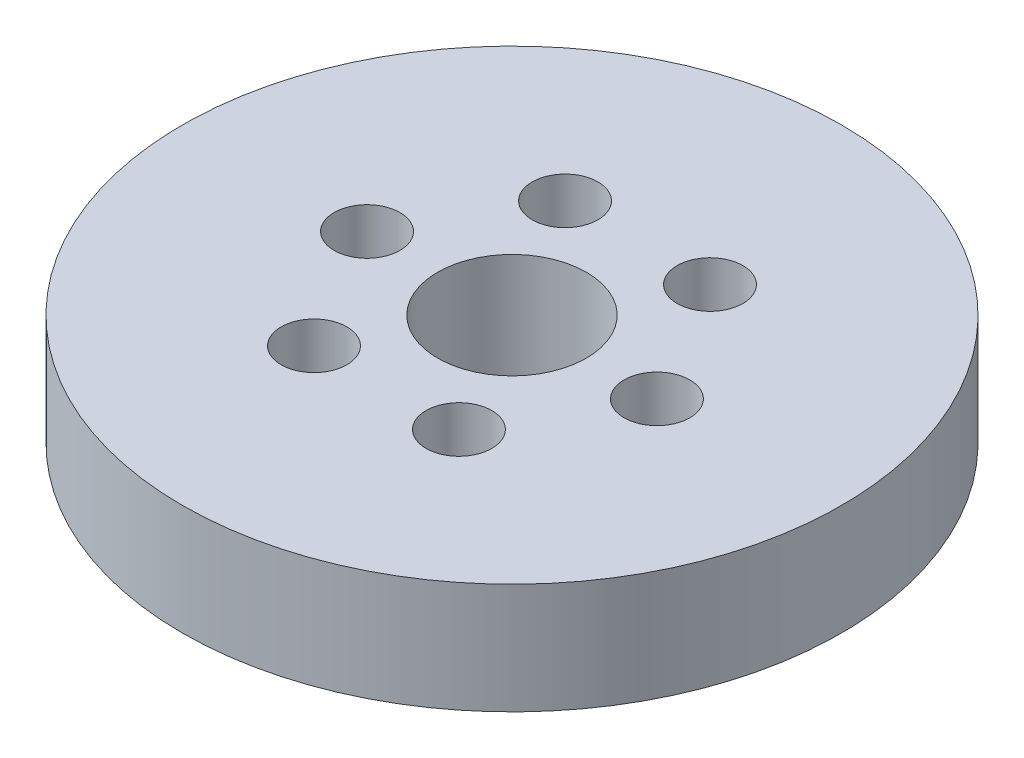
ISO-10303-21;
HEADER;
FILE_DESCRIPTION(('STEP AP214'),'2;1');
FILE_NAME('part.step','',(''),(''),'','','');
FILE_SCHEMA(('AUTOMOTIVE_DESIGN { 1 0 10303 214 1 1 1 1 }'));
ENDSEC;
DATA;
#1=APPLICATION_CONTEXT('core data for automotive mechanical design processes');
#2=APPLICATION_PROTOCOL_DEFINITION('international standard','automotive_design',2000,#1);
#3=PRODUCT_CONTEXT('',#1,'mechanical');
#4=PRODUCT('Part','Part','',(#3));
#5=PRODUCT_RELATED_PRODUCT_CATEGORY('part','',(#4));
#6=PRODUCT_DEFINITION_FORMATION('','',#4);
#7=PRODUCT_DEFINITION_CONTEXT('part definition',#1,'design');
#8=PRODUCT_DEFINITION('design','',#6,#7);
#9=PRODUCT_DEFINITION_SHAPE('','',#8);
#10=(LENGTH_UNIT() NAMED_UNIT(*) SI_UNIT(.MILLI.,.METRE.));
#11=(NAMED_UNIT(*) PLANE_ANGLE_UNIT() SI_UNIT($,.RADIAN.));
#12=(NAMED_UNIT(*) SI_UNIT($,.STERADIAN.) SOLID_ANGLE_UNIT());
#13=UNCERTAINTY_MEASURE_WITH_UNIT(LENGTH_MEASURE(1.E-05),#10,'distance_accuracy_value','');
#14=(GEOMETRIC_REPRESENTATION_CONTEXT(3) GLOBAL_UNCERTAINTY_ASSIGNED_CONTEXT((#13)) GLOBAL_UNIT_ASSIGNED_CONTEXT((#10,
#11,#12)) REPRESENTATION_CONTEXT('',''));
#15=CARTESIAN_POINT('',(0.,0.,0.));
#16=DIRECTION('',(0.,0.,1.));
#17=DIRECTION('',(1.,0.,0.));
#18=AXIS2_PLACEMENT_3D('',#15,#16,#17);
#19=CARTESIAN_POINT('',(0.,26.,0.));
#20=DIRECTION('',(0.,-1.,0.));
#21=DIRECTION('',(0.,0.,-1.));
#22=AXIS2_PLACEMENT_3D('',#19,#20,#21);
#23=CYLINDRICAL_SURFACE('',#22,77.5);
#24=CARTESIAN_POINT('',(0.,26.,0.));
#25=DIRECTION('',(0.,1.,0.));
#26=DIRECTION('',(0.,0.,1.));
#27=AXIS2_PLACEMENT_3D('',#24,#25,#26);
#28=CIRCLE('',#27,77.5);
#29=CARTESIAN_POINT('',(0.,26.,-77.5));
#30=VERTEX_POINT('',#29);
#31=EDGE_CURVE('E10',#30,#30,#28,.T.);
#32=CARTESIAN_POINT('',(0.,0.,0.));
#33=DIRECTION('',(0.,1.,0.));
#34=DIRECTION('',(0.,0.,1.));
#35=AXIS2_PLACEMENT_3D('',#32,#33,#34);
#36=CIRCLE('',#35,77.5);
#37=CARTESIAN_POINT('',(0.,0.,-77.5));
#38=VERTEX_POINT('',#37);
#39=EDGE_CURVE('E37',#38,#38,#36,.T.);
#40=CARTESIAN_POINT('',(0.,26.,-77.5));
#41=CARTESIAN_POINT('',(0.,25.7291666666667,-77.5));
#42=CARTESIAN_POINT('',(0.,25.4583333333333,-77.5));
#43=CARTESIAN_POINT('',(0.,24.9166666666667,-77.5));
#44=CARTESIAN_POINT('',(0.,24.6458333333333,-77.5));
#45=CARTESIAN_POINT('',(0.,24.1041666666667,-77.5));
#46=CARTESIAN_POINT('',(0.,23.8333333333333,-77.5));
#47=CARTESIAN_POINT('',(0.,23.2916666666667,-77.5));
#48=CARTESIAN_POINT('',(0.,23.0208333333333,-77.5));
#49=CARTESIAN_POINT('',(0.,22.4791666666667,-77.5));
#50=CARTESIAN_POINT('',(0.,22.2083333333333,-77.5));
#51=CARTESIAN_POINT('',(0.,21.6666666666667,-77.5));
#52=CARTESIAN_POINT('',(0.,21.3958333333333,-77.5));
#53=CARTESIAN_POINT('',(0.,20.8541666666667,-77.5));
#54=CARTESIAN_POINT('',(0.,20.5833333333333,-77.5));
#55=CARTESIAN_POINT('',(0.,20.0416666666667,-77.5));
#56=CARTESIAN_POINT('',(0.,19.7708333333333,-77.5));
#57=CARTESIAN_POINT('',(0.,19.2291666666667,-77.5));
#58=CARTESIAN_POINT('',(0.,18.9583333333333,-77.5));
#59=CARTESIAN_POINT('',(0.,18.4166666666667,-77.5));
#60=CARTESIAN_POINT('',(0.,18.1458333333333,-77.5));
#61=CARTESIAN_POINT('',(0.,17.6041666666667,-77.5));
#62=CARTESIAN_POINT('',(0.,17.3333333333333,-77.5));
#63=CARTESIAN_POINT('',(0.,16.7916666666667,-77.5));
#64=CARTESIAN_POINT('',(0.,16.5208333333333,-77.5));
#65=CARTESIAN_POINT('',(0.,15.9791666666667,-77.5));
#66=CARTESIAN_POINT('',(0.,15.7083333333333,-77.5));
#67=CARTESIAN_POINT('',(0.,15.1666666666667,-77.5));
#68=CARTESIAN_POINT('',(0.,14.8958333333333,-77.5));
#69=CARTESIAN_POINT('',(0.,14.3541666666667,-77.5));
#70=CARTESIAN_POINT('',(0.,14.0833333333333,-77.5));
#71=CARTESIAN_POINT('',(0.,13.5416666666667,-77.5));
#72=CARTESIAN_POINT('',(0.,13.2708333333333,-77.5));
#73=CARTESIAN_POINT('',(0.,12.7291666666667,-77.5));
#74=CARTESIAN_POINT('',(0.,12.4583333333333,-77.5));
#75=CARTESIAN_POINT('',(0.,11.9166666666667,-77.5));
#76=CARTESIAN_POINT('',(0.,11.6458333333333,-77.5));
#77=CARTESIAN_POINT('',(0.,11.1041666666667,-77.5));
#78=CARTESIAN_POINT('',(0.,10.8333333333333,-77.5));
#79=CARTESIAN_POINT('',(0.,10.2916666666667,-77.5));
#80=CARTESIAN_POINT('',(0.,10.0208333333333,-77.5));
#81=CARTESIAN_POINT('',(0.,9.47916666666667,-77.5));
#82=CARTESIAN_POINT('',(0.,9.20833333333333,-77.5));
#83=CARTESIAN_POINT('',(0.,8.66666666666667,-77.5));
#84=CARTESIAN_POINT('',(0.,8.39583333333333,-77.5));
#85=CARTESIAN_POINT('',(0.,7.85416666666667,-77.5));
#86=CARTESIAN_POINT('',(0.,7.58333333333333,-77.5));
#87=CARTESIAN_POINT('',(0.,7.04166666666667,-77.5));
#88=CARTESIAN_POINT('',(0.,6.77083333333333,-77.5));
#89=CARTESIAN_POINT('',(0.,6.22916666666667,-77.5));
#90=CARTESIAN_POINT('',(0.,5.95833333333333,-77.5));
#91=CARTESIAN_POINT('',(0.,5.41666666666667,-77.5));
#92=CARTESIAN_POINT('',(0.,5.14583333333333,-77.5));
#93=CARTESIAN_POINT('',(0.,4.60416666666667,-77.5));
#94=CARTESIAN_POINT('',(0.,4.33333333333333,-77.5));
#95=CARTESIAN_POINT('',(0.,3.79166666666667,-77.5));
#96=CARTESIAN_POINT('',(0.,3.52083333333333,-77.5));
#97=CARTESIAN_POINT('',(0.,2.97916666666667,-77.5));
#98=CARTESIAN_POINT('',(0.,2.70833333333333,-77.5));
#99=CARTESIAN_POINT('',(0.,2.16666666666667,-77.5));
#100=CARTESIAN_POINT('',(0.,1.89583333333333,-77.5));
#101=CARTESIAN_POINT('',(0.,1.35416666666667,-77.5));
#102=CARTESIAN_POINT('',(0.,1.08333333333333,-77.5));
#103=CARTESIAN_POINT('',(0.,0.541666666666667,-77.5));
#104=CARTESIAN_POINT('',(0.,0.270833333333334,-77.5));
#105=CARTESIAN_POINT('',(0.,0.,-77.5));
#106=B_SPLINE_CURVE_WITH_KNOTS('',3,(#40,#41,#42,#43,#44,#45,#46,#47,#48,#49,#50,#51,#52,#53,
#54,#55,#56,#57,#58,#59,#60,#61,#62,#63,#64,#65,#66,#67,#68,#69,#70,#71,#72,#73,#74,#75,#76,#77,
#78,#79,#80,#81,#82,#83,#84,#85,#86,#87,#88,#89,#90,#91,#92,#93,#94,#95,#96,#97,#98,#99,#100,
#101,#102,#103,#104,#105),.UNSPECIFIED.,.F.,.F.,(4,2,2,2,2,2,2,2,2,2,2,2,2,2,2,2,2,2,2,2,2,2,2,
2,2,2,2,2,2,2,2,2,4),(0.,0.812499999999997,1.625,2.4375,3.25,4.0625,4.875,5.6875,6.5,7.3125,
8.125,8.93749999999999,9.74999999999999,10.5625,11.375,12.1875,13.,13.8125,14.625,15.4375,16.25,
17.0625,17.875,18.6875,19.5,20.3125,21.125,21.9375,22.75,23.5625,24.375,25.1875,26.),.UNSPECIFIED.);
#107=EDGE_CURVE('BSEAM40',#30,#38,#106,.T.);
#108=ORIENTED_EDGE('',*,*,#31,.F.);
#109=ORIENTED_EDGE('',*,*,#39,.T.);
#110=ORIENTED_EDGE('',*,*,#107,.T.);
#111=ORIENTED_EDGE('',*,*,#107,.F.);
#112=EDGE_LOOP('',(#108,#110,#109,#111));
#113=FACE_BOUND('',#112,.T.);
#114=ADVANCED_FACE('F40',(#113),#23,.T.);
#115=CARTESIAN_POINT('',(0.,26.,0.));
#116=DIRECTION('',(0.,1.,0.));
#117=DIRECTION('',(0.,0.,1.));
#118=AXIS2_PLACEMENT_3D('',#115,#116,#117);
#119=PLANE('',#118);
#120=CARTESIAN_POINT('',(-17.0432717372011,26.,-29.5198125760343));
#121=DIRECTION('',(0.,1.,0.));
#122=DIRECTION('',(-0.866025403784433,0.,0.50000000000001));
#123=AXIS2_PLACEMENT_3D('',#120,#121,#122);
#124=CIRCLE('',#123,7.72952731241118);
#125=CARTESIAN_POINT('',(-23.7372387489948,26.,-25.6550489198286));
#126=VERTEX_POINT('',#125);
#127=EDGE_CURVE('E70',#126,#126,#124,.T.);
#128=ORIENTED_EDGE('',*,*,#127,.F.);
#129=EDGE_LOOP('',(#128));
#130=FACE_BOUND('',#129,.T.);
#131=CARTESIAN_POINT('',(17.0432717372005,26.,-29.5198125760346));
#132=DIRECTION('',(0.,1.,0.));
#133=DIRECTION('',(-0.866025403784443,0.,-0.499999999999992));
#134=AXIS2_PLACEMENT_3D('',#131,#132,#133);
#135=CIRCLE('',#134,7.72952731241118);
#136=CARTESIAN_POINT('',(10.3493047254068,26.,-33.3845762322402));
#137=VERTEX_POINT('',#136);
#138=EDGE_CURVE('E71',#137,#137,#135,.T.);
#139=ORIENTED_EDGE('',*,*,#138,.F.);
#140=EDGE_LOOP('',(#139));
#141=FACE_BOUND('',#140,.T.);
#142=CARTESIAN_POINT('',(34.0865434744016,26.,0.));
#143=DIRECTION('',(0.,1.,0.));
#144=DIRECTION('',(0.,0.,-1.));
#145=AXIS2_PLACEMENT_3D('',#142,#143,#144);
#146=CIRCLE('',#145,7.72952731241118);
#147=CARTESIAN_POINT('',(34.0865434744016,26.,-7.72952731241118));
#148=VERTEX_POINT('',#147);
#149=EDGE_CURVE('E78',#148,#148,#146,.T.);
#150=ORIENTED_EDGE('',*,*,#149,.F.);
#151=EDGE_LOOP('',(#150));
#152=FACE_BOUND('',#151,.T.);
#153=CARTESIAN_POINT('',(17.0432717372009,26.,29.5198125760344));
#154=DIRECTION('',(0.,1.,0.));
#155=DIRECTION('',(0.866025403784436,0.,-0.500000000000004));
#156=AXIS2_PLACEMENT_3D('',#153,#154,#155);
#157=CIRCLE('',#156,7.72952731241118);
#158=CARTESIAN_POINT('',(23.7372387489947,26.,25.6550489198288));
#159=VERTEX_POINT('',#158);
#160=EDGE_CURVE('E84',#159,#159,#157,.T.);
#161=ORIENTED_EDGE('',*,*,#160,.F.);
#162=EDGE_LOOP('',(#161));
#163=FACE_BOUND('',#162,.T.);
#164=CARTESIAN_POINT('',(-17.0432717372007,26.,29.5198125760345));
#165=DIRECTION('',(0.,1.,0.));
#166=DIRECTION('',(0.86602540378444,0.,0.499999999999998));
#167=AXIS2_PLACEMENT_3D('',#164,#165,#166);
#168=CIRCLE('',#167,7.72952731241118);
#169=CARTESIAN_POINT('',(-10.349304725407,26.,33.3845762322401));
#170=VERTEX_POINT('',#169);
#171=EDGE_CURVE('E61',#170,#170,#168,.T.);
#172=ORIENTED_EDGE('',*,*,#171,.F.);
#173=EDGE_LOOP('',(#172));
#174=FACE_BOUND('',#173,.T.);
#175=CARTESIAN_POINT('',(-34.0865434744016,26.,0.));
#176=DIRECTION('',(0.,1.,0.));
#177=DIRECTION('',(0.,0.,1.));
#178=AXIS2_PLACEMENT_3D('',#175,#176,#177);
#179=CIRCLE('',#178,7.72952731241118);
#180=CARTESIAN_POINT('',(-34.0865434744016,26.,7.72952731241118));
#181=VERTEX_POINT('',#180);
#182=EDGE_CURVE('E54',#181,#181,#179,.T.);
#183=ORIENTED_EDGE('',*,*,#182,.F.);
#184=EDGE_LOOP('',(#183));
#185=FACE_BOUND('',#184,.T.);
#186=CARTESIAN_POINT('',(0.,26.,0.));
#187=DIRECTION('',(0.,1.,0.));
#188=DIRECTION('',(0.,0.,1.));
#189=AXIS2_PLACEMENT_3D('',#186,#187,#188);
#190=CIRCLE('',#189,17.5);
#191=CARTESIAN_POINT('',(0.,26.,-17.5));
#192=VERTEX_POINT('',#191);
#193=EDGE_CURVE('E50',#192,#192,#190,.T.);
#194=ORIENTED_EDGE('',*,*,#193,.F.);
#195=EDGE_LOOP('',(#194));
#196=FACE_BOUND('',#195,.T.);
#197=ORIENTED_EDGE('',*,*,#31,.T.);
#198=EDGE_LOOP('',(#197));
#199=FACE_BOUND('',#198,.T.);
#200=ADVANCED_FACE('F99',(#130,#141,#152,#163,#174,#185,#196,#199),#119,.T.);
#201=CARTESIAN_POINT('',(0.,0.,0.));
#202=DIRECTION('',(0.,1.,0.));
#203=DIRECTION('',(0.,0.,1.));
#204=AXIS2_PLACEMENT_3D('',#201,#202,#203);
#205=PLANE('',#204);
#206=CARTESIAN_POINT('',(0.,0.,0.));
#207=DIRECTION('',(0.,1.,0.));
#208=DIRECTION('',(0.,0.,1.));
#209=AXIS2_PLACEMENT_3D('',#206,#207,#208);
#210=CIRCLE('',#209,17.5);
#211=CARTESIAN_POINT('',(0.,0.,-17.5));
#212=VERTEX_POINT('',#211);
#213=EDGE_CURVE('E47',#212,#212,#210,.T.);
#214=ORIENTED_EDGE('',*,*,#213,.T.);
#215=EDGE_LOOP('',(#214));
#216=FACE_BOUND('',#215,.T.);
#217=ORIENTED_EDGE('',*,*,#39,.F.);
#218=EDGE_LOOP('',(#217));
#219=FACE_BOUND('',#218,.T.);
#220=ADVANCED_FACE('F103',(#216,#219),#205,.F.);
#221=CARTESIAN_POINT('',(0.,26.,0.));
#222=DIRECTION('',(0.,-1.,0.));
#223=DIRECTION('',(0.,0.,-1.));
#224=AXIS2_PLACEMENT_3D('',#221,#222,#223);
#225=CYLINDRICAL_SURFACE('',#224,17.5);
#226=CARTESIAN_POINT('',(0.,26.,-17.5));
#227=CARTESIAN_POINT('',(0.,25.7291666666667,-17.5));
#228=CARTESIAN_POINT('',(0.,25.4583333333333,-17.5));
#229=CARTESIAN_POINT('',(0.,24.9166666666667,-17.5));
#230=CARTESIAN_POINT('',(0.,24.6458333333333,-17.5));
#231=CARTESIAN_POINT('',(0.,24.1041666666667,-17.5));
#232=CARTESIAN_POINT('',(0.,23.8333333333333,-17.5));
#233=CARTESIAN_POINT('',(0.,23.2916666666667,-17.5));
#234=CARTESIAN_POINT('',(0.,23.0208333333333,-17.5));
#235=CARTESIAN_POINT('',(0.,22.4791666666667,-17.5));
#236=CARTESIAN_POINT('',(0.,22.2083333333333,-17.5));
#237=CARTESIAN_POINT('',(0.,21.6666666666667,-17.5));
#238=CARTESIAN_POINT('',(0.,21.3958333333333,-17.5));
#239=CARTESIAN_POINT('',(0.,20.8541666666667,-17.5));
#240=CARTESIAN_POINT('',(0.,20.5833333333333,-17.5));
#241=CARTESIAN_POINT('',(0.,20.0416666666667,-17.5));
#242=CARTESIAN_POINT('',(0.,19.7708333333333,-17.5));
#243=CARTESIAN_POINT('',(0.,19.2291666666667,-17.5));
#244=CARTESIAN_POINT('',(0.,18.9583333333333,-17.5));
#245=CARTESIAN_POINT('',(0.,18.4166666666667,-17.5));
#246=CARTESIAN_POINT('',(0.,18.1458333333333,-17.5));
#247=CARTESIAN_POINT('',(0.,17.6041666666667,-17.5));
#248=CARTESIAN_POINT('',(0.,17.3333333333333,-17.5));
#249=CARTESIAN_POINT('',(0.,16.7916666666667,-17.5));
#250=CARTESIAN_POINT('',(0.,16.5208333333333,-17.5));
#251=CARTESIAN_POINT('',(0.,15.9791666666667,-17.5));
#252=CARTESIAN_POINT('',(0.,15.7083333333333,-17.5));
#253=CARTESIAN_POINT('',(0.,15.1666666666667,-17.5));
#254=CARTESIAN_POINT('',(0.,14.8958333333333,-17.5));
#255=CARTESIAN_POINT('',(0.,14.3541666666667,-17.5));
#256=CARTESIAN_POINT('',(0.,14.0833333333333,-17.5));
#257=CARTESIAN_POINT('',(0.,13.5416666666667,-17.5));
#258=CARTESIAN_POINT('',(0.,13.2708333333333,-17.5));
#259=CARTESIAN_POINT('',(0.,12.7291666666667,-17.5));
#260=CARTESIAN_POINT('',(0.,12.4583333333333,-17.5));
#261=CARTESIAN_POINT('',(0.,11.9166666666667,-17.5));
#262=CARTESIAN_POINT('',(0.,11.6458333333333,-17.5));
#263=CARTESIAN_POINT('',(0.,11.1041666666667,-17.5));
#264=CARTESIAN_POINT('',(0.,10.8333333333333,-17.5));
#265=CARTESIAN_POINT('',(0.,10.2916666666667,-17.5));
#266=CARTESIAN_POINT('',(0.,10.0208333333333,-17.5));
#267=CARTESIAN_POINT('',(0.,9.47916666666667,-17.5));
#268=CARTESIAN_POINT('',(0.,9.20833333333333,-17.5));
#269=CARTESIAN_POINT('',(0.,8.66666666666667,-17.5));
#270=CARTESIAN_POINT('',(0.,8.39583333333333,-17.5));
#271=CARTESIAN_POINT('',(0.,7.85416666666667,-17.5));
#272=CARTESIAN_POINT('',(0.,7.58333333333333,-17.5));
#273=CARTESIAN_POINT('',(0.,7.04166666666667,-17.5));
#274=CARTESIAN_POINT('',(0.,6.77083333333333,-17.5));
#275=CARTESIAN_POINT('',(0.,6.22916666666667,-17.5));
#276=CARTESIAN_POINT('',(0.,5.95833333333333,-17.5));
#277=CARTESIAN_POINT('',(0.,5.41666666666667,-17.5));
#278=CARTESIAN_POINT('',(0.,5.14583333333333,-17.5));
#279=CARTESIAN_POINT('',(0.,4.60416666666667,-17.5));
#280=CARTESIAN_POINT('',(0.,4.33333333333333,-17.5));
#281=CARTESIAN_POINT('',(0.,3.79166666666667,-17.5));
#282=CARTESIAN_POINT('',(0.,3.52083333333333,-17.5));
#283=CARTESIAN_POINT('',(0.,2.97916666666667,-17.5));
#284=CARTESIAN_POINT('',(0.,2.70833333333333,-17.5));
#285=CARTESIAN_POINT('',(0.,2.16666666666667,-17.5));
#286=CARTESIAN_POINT('',(0.,1.89583333333333,-17.5));
#287=CARTESIAN_POINT('',(0.,1.35416666666667,-17.5));
#288=CARTESIAN_POINT('',(0.,1.08333333333333,-17.5));
#289=CARTESIAN_POINT('',(0.,0.541666666666667,-17.5));
#290=CARTESIAN_POINT('',(0.,0.270833333333334,-17.5));
#291=CARTESIAN_POINT('',(0.,0.,-17.5));
#292=B_SPLINE_CURVE_WITH_KNOTS('',3,(#226,#227,#228,#229,#230,#231,#232,#233,#234,#235,#236,
#237,#238,#239,#240,#241,#242,#243,#244,#245,#246,#247,#248,#249,#250,#251,#252,#253,#254,#255,
#256,#257,#258,#259,#260,#261,#262,#263,#264,#265,#266,#267,#268,#269,#270,#271,#272,#273,#274,
#275,#276,#277,#278,#279,#280,#281,#282,#283,#284,#285,#286,#287,#288,#289,#290,#291),
.UNSPECIFIED.,.F.,.F.,(4,2,2,2,2,2,2,2,2,2,2,2,2,2,2,2,2,2,2,2,2,2,2,2,2,2,2,2,2,2,2,2,4),(0.,
0.812500000000001,1.625,2.4375,3.25,4.0625,4.875,5.6875,6.5,7.3125,8.125,8.9375,9.75,10.5625,
11.375,12.1875,13.,13.8125,14.625,15.4375,16.25,17.0625,17.875,18.6875,19.5,20.3125,21.125,
21.9375,22.75,23.5625,24.375,25.1875,26.),.UNSPECIFIED.);
#293=EDGE_CURVE('BSEAM115',#192,#212,#292,.T.);
#294=ORIENTED_EDGE('',*,*,#193,.T.);
#295=ORIENTED_EDGE('',*,*,#213,.F.);
#296=ORIENTED_EDGE('',*,*,#293,.T.);
#297=ORIENTED_EDGE('',*,*,#293,.F.);
#298=EDGE_LOOP('',(#294,#296,#295,#297));
#299=FACE_BOUND('',#298,.T.);
#300=ADVANCED_FACE('F115',(#299),#225,.F.);
#301=CARTESIAN_POINT('',(-34.0865434744016,4.0920131426709,0.));
#302=DIRECTION('',(0.,1.,0.));
#303=DIRECTION('',(0.,0.,1.));
#304=AXIS2_PLACEMENT_3D('',#301,#302,#303);
#305=CYLINDRICAL_SURFACE('',#304,7.72952731241118);
#306=CARTESIAN_POINT('',(-34.0865434744016,4.0920131426709,0.));
#307=DIRECTION('',(0.,1.,0.));
#308=DIRECTION('',(0.,0.,1.));
#309=AXIS2_PLACEMENT_3D('',#306,#307,#308);
#310=CIRCLE('',#309,7.72952731241118);
#311=CARTESIAN_POINT('',(-34.0865434744016,4.0920131426709,7.72952731241118));
#312=VERTEX_POINT('',#311);
#313=EDGE_CURVE('E55',#312,#312,#310,.T.);
#314=ORIENTED_EDGE('',*,*,#313,.F.);
#315=EDGE_LOOP('',(#314));
#316=FACE_BOUND('',#315,.T.);
#317=ORIENTED_EDGE('',*,*,#182,.T.);
#318=EDGE_LOOP('',(#317));
#319=FACE_BOUND('',#318,.T.);
#320=ADVANCED_FACE('F113',(#316,#319),#305,.F.);
#321=CARTESIAN_POINT('',(-34.0865434744016,4.0920131426709,0.));
#322=DIRECTION('',(0.,1.,0.));
#323=DIRECTION('',(0.,0.,1.));
#324=AXIS2_PLACEMENT_3D('',#321,#322,#323);
#325=PLANE('',#324);
#326=ORIENTED_EDGE('',*,*,#313,.T.);
#327=EDGE_LOOP('',(#326));
#328=FACE_BOUND('',#327,.T.);
#329=ADVANCED_FACE('F144',(#328),#325,.T.);
#330=CARTESIAN_POINT('',(-17.0432717372007,4.0920131426709,29.5198125760345));
#331=DIRECTION('',(0.,1.,0.));
#332=DIRECTION('',(0.,0.,1.));
#333=AXIS2_PLACEMENT_3D('',#330,#331,#332);
#334=CYLINDRICAL_SURFACE('',#333,7.72952731241118);
#335=CARTESIAN_POINT('',(-17.0432717372007,4.0920131426709,29.5198125760345));
#336=DIRECTION('',(0.,1.,0.));
#337=DIRECTION('',(0.86602540378444,0.,0.499999999999998));
#338=AXIS2_PLACEMENT_3D('',#335,#336,#337);
#339=CIRCLE('',#338,7.72952731241118);
#340=CARTESIAN_POINT('',(-10.349304725407,4.0920131426709,33.3845762322401));
#341=VERTEX_POINT('',#340);
#342=EDGE_CURVE('E59',#341,#341,#339,.T.);
#343=ORIENTED_EDGE('',*,*,#342,.F.);
#344=EDGE_LOOP('',(#343));
#345=FACE_BOUND('',#344,.T.);
#346=ORIENTED_EDGE('',*,*,#171,.T.);
#347=EDGE_LOOP('',(#346));
#348=FACE_BOUND('',#347,.T.);
#349=ADVANCED_FACE('F153',(#345,#348),#334,.F.);
#350=CARTESIAN_POINT('',(-17.0432717372007,4.0920131426709,29.5198125760345));
#351=DIRECTION('',(0.,1.,0.));
#352=DIRECTION('',(0.86602540378444,0.,0.499999999999998));
#353=AXIS2_PLACEMENT_3D('',#350,#351,#352);
#354=PLANE('',#353);
#355=ORIENTED_EDGE('',*,*,#342,.T.);
#356=EDGE_LOOP('',(#355));
#357=FACE_BOUND('',#356,.T.);
#358=ADVANCED_FACE('F96',(#357),#354,.T.);
#359=CARTESIAN_POINT('',(17.0432717372009,4.0920131426709,29.5198125760344));
#360=DIRECTION('',(0.,1.,0.));
#361=DIRECTION('',(0.,0.,1.));
#362=AXIS2_PLACEMENT_3D('',#359,#360,#361);
#363=CYLINDRICAL_SURFACE('',#362,7.72952731241118);
#364=CARTESIAN_POINT('',(17.0432717372009,4.0920131426709,29.5198125760344));
#365=DIRECTION('',(0.,1.,0.));
#366=DIRECTION('',(0.866025403784436,0.,-0.500000000000004));
#367=AXIS2_PLACEMENT_3D('',#364,#365,#366);
#368=CIRCLE('',#367,7.72952731241118);
#369=CARTESIAN_POINT('',(23.7372387489947,4.0920131426709,25.6550489198288));
#370=VERTEX_POINT('',#369);
#371=EDGE_CURVE('E63',#370,#370,#368,.T.);
#372=ORIENTED_EDGE('',*,*,#371,.F.);
#373=EDGE_LOOP('',(#372));
#374=FACE_BOUND('',#373,.T.);
#375=ORIENTED_EDGE('',*,*,#160,.T.);
#376=EDGE_LOOP('',(#375));
#377=FACE_BOUND('',#376,.T.);
#378=ADVANCED_FACE('F91',(#374,#377),#363,.F.);
#379=CARTESIAN_POINT('',(17.0432717372009,4.0920131426709,29.5198125760344));
#380=DIRECTION('',(0.,1.,0.));
#381=DIRECTION('',(0.866025403784436,0.,-0.500000000000004));
#382=AXIS2_PLACEMENT_3D('',#379,#380,#381);
#383=PLANE('',#382);
#384=ORIENTED_EDGE('',*,*,#371,.T.);
#385=EDGE_LOOP('',(#384));
#386=FACE_BOUND('',#385,.T.);
#387=ADVANCED_FACE('F93',(#386),#383,.T.);
#388=CARTESIAN_POINT('',(34.0865434744016,4.0920131426709,0.));
#389=DIRECTION('',(0.,1.,0.));
#390=DIRECTION('',(0.,0.,1.));
#391=AXIS2_PLACEMENT_3D('',#388,#389,#390);
#392=CYLINDRICAL_SURFACE('',#391,7.72952731241118);
#393=CARTESIAN_POINT('',(34.0865434744016,4.0920131426709,0.));
#394=DIRECTION('',(0.,1.,0.));
#395=DIRECTION('',(0.,0.,-1.));
#396=AXIS2_PLACEMENT_3D('',#393,#394,#395);
#397=CIRCLE('',#396,7.72952731241118);
#398=CARTESIAN_POINT('',(34.0865434744016,4.0920131426709,-7.72952731241118));
#399=VERTEX_POINT('',#398);
#400=EDGE_CURVE('E85',#399,#399,#397,.T.);
#401=ORIENTED_EDGE('',*,*,#400,.F.);
#402=EDGE_LOOP('',(#401));
#403=FACE_BOUND('',#402,.T.);
#404=ORIENTED_EDGE('',*,*,#149,.T.);
#405=EDGE_LOOP('',(#404));
#406=FACE_BOUND('',#405,.T.);
#407=ADVANCED_FACE('F187',(#403,#406),#392,.F.);
#408=CARTESIAN_POINT('',(34.0865434744016,4.0920131426709,0.));
#409=DIRECTION('',(0.,1.,0.));
#410=DIRECTION('',(0.,0.,-1.));
#411=AXIS2_PLACEMENT_3D('',#408,#409,#410);
#412=PLANE('',#411);
#413=ORIENTED_EDGE('',*,*,#400,.T.);
#414=EDGE_LOOP('',(#413));
#415=FACE_BOUND('',#414,.T.);
#416=ADVANCED_FACE('F198',(#415),#412,.T.);
#417=CARTESIAN_POINT('',(17.0432717372005,4.0920131426709,-29.5198125760346));
#418=DIRECTION('',(0.,1.,0.));
#419=DIRECTION('',(0.,0.,1.));
#420=AXIS2_PLACEMENT_3D('',#417,#418,#419);
#421=CYLINDRICAL_SURFACE('',#420,7.72952731241118);
#422=CARTESIAN_POINT('',(17.0432717372005,4.0920131426709,-29.5198125760346));
#423=DIRECTION('',(0.,1.,0.));
#424=DIRECTION('',(-0.866025403784443,0.,-0.499999999999992));
#425=AXIS2_PLACEMENT_3D('',#422,#423,#424);
#426=CIRCLE('',#425,7.72952731241118);
#427=CARTESIAN_POINT('',(10.3493047254068,4.0920131426709,-33.3845762322402));
#428=VERTEX_POINT('',#427);
#429=EDGE_CURVE('E76',#428,#428,#426,.T.);
#430=ORIENTED_EDGE('',*,*,#429,.F.);
#431=EDGE_LOOP('',(#430));
#432=FACE_BOUND('',#431,.T.);
#433=ORIENTED_EDGE('',*,*,#138,.T.);
#434=EDGE_LOOP('',(#433));
#435=FACE_BOUND('',#434,.T.);
#436=ADVANCED_FACE('F202',(#432,#435),#421,.F.);
#437=CARTESIAN_POINT('',(17.0432717372005,4.0920131426709,-29.5198125760346));
#438=DIRECTION('',(0.,1.,0.));
#439=DIRECTION('',(-0.866025403784443,0.,-0.499999999999992));
#440=AXIS2_PLACEMENT_3D('',#437,#438,#439);
#441=PLANE('',#440);
#442=ORIENTED_EDGE('',*,*,#429,.T.);
#443=EDGE_LOOP('',(#442));
#444=FACE_BOUND('',#443,.T.);
#445=ADVANCED_FACE('F212',(#444),#441,.T.);
#446=CARTESIAN_POINT('',(-17.0432717372011,4.0920131426709,-29.5198125760343));
#447=DIRECTION('',(0.,1.,0.));
#448=DIRECTION('',(0.,0.,1.));
#449=AXIS2_PLACEMENT_3D('',#446,#447,#448);
#450=CYLINDRICAL_SURFACE('',#449,7.72952731241118);
#451=CARTESIAN_POINT('',(-17.0432717372011,4.0920131426709,-29.5198125760343));
#452=DIRECTION('',(0.,1.,0.));
#453=DIRECTION('',(-0.866025403784433,0.,0.50000000000001));
#454=AXIS2_PLACEMENT_3D('',#451,#452,#453);
#455=CIRCLE('',#454,7.72952731241118);
#456=CARTESIAN_POINT('',(-23.7372387489948,4.0920131426709,-25.6550489198286));
#457=VERTEX_POINT('',#456);
#458=EDGE_CURVE('E69',#457,#457,#455,.T.);
#459=ORIENTED_EDGE('',*,*,#458,.F.);
#460=EDGE_LOOP('',(#459));
#461=FACE_BOUND('',#460,.T.);
#462=ORIENTED_EDGE('',*,*,#127,.T.);
#463=EDGE_LOOP('',(#462));
#464=FACE_BOUND('',#463,.T.);
#465=ADVANCED_FACE('F224',(#461,#464),#450,.F.);
#466=CARTESIAN_POINT('',(-17.0432717372011,4.0920131426709,-29.5198125760343));
#467=DIRECTION('',(0.,1.,0.));
#468=DIRECTION('',(-0.866025403784433,0.,0.50000000000001));
#469=AXIS2_PLACEMENT_3D('',#466,#467,#468);
#470=PLANE('',#469);
#471=ORIENTED_EDGE('',*,*,#458,.T.);
#472=EDGE_LOOP('',(#471));
#473=FACE_BOUND('',#472,.T.);
#474=ADVANCED_FACE('F235',(#473),#470,.T.);
#475=CLOSED_SHELL('',(#114,#200,#220,#300,#320,#329,#349,#358,#378,#387,#407,#416,#436,#445,
#465,#474));
#476=MANIFOLD_SOLID_BREP('B2',#475);
#477=ADVANCED_BREP_SHAPE_REPRESENTATION('',(#18,#476),#14);
#478=SHAPE_DEFINITION_REPRESENTATION(#9,#477);
ENDSEC;
END-ISO-10303-21;
